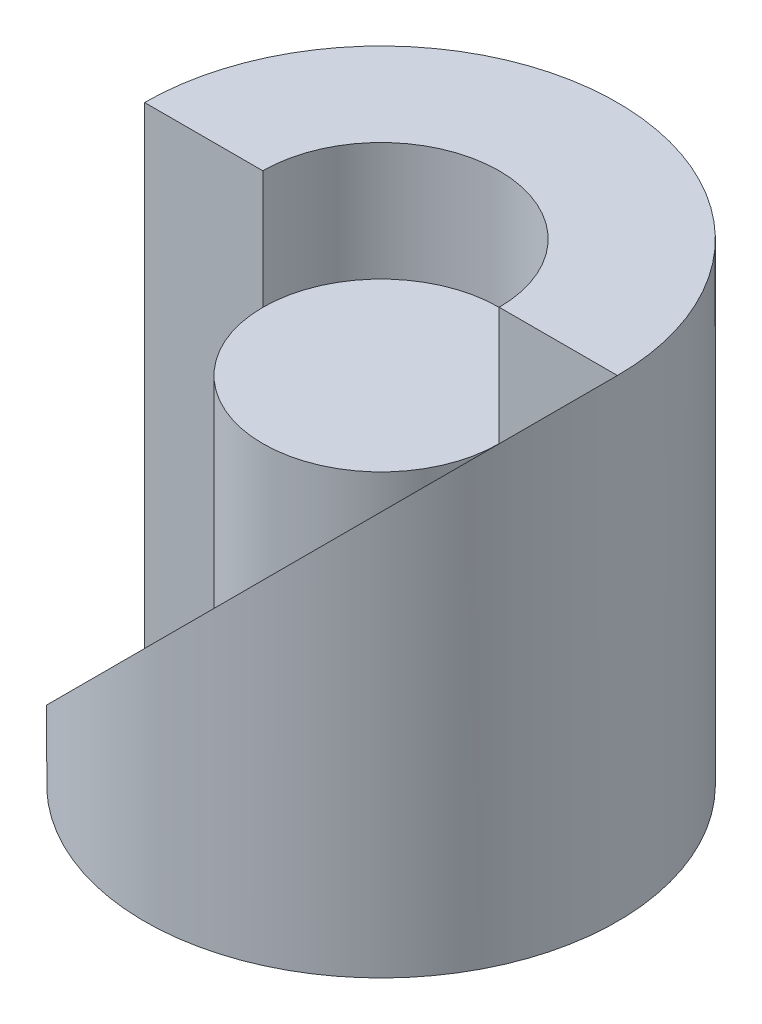
ISO-10303-21;
HEADER;
FILE_DESCRIPTION(('STEP AP214'),'2;1');
FILE_NAME('part.step','',(''),(''),'','','');
FILE_SCHEMA(('AUTOMOTIVE_DESIGN { 1 0 10303 214 1 1 1 1 }'));
ENDSEC;
DATA;
#1=APPLICATION_CONTEXT('core data for automotive mechanical design processes');
#2=APPLICATION_PROTOCOL_DEFINITION('international standard','automotive_design',2000,#1);
#3=PRODUCT_CONTEXT('',#1,'mechanical');
#4=PRODUCT('Part','Part','',(#3));
#5=PRODUCT_RELATED_PRODUCT_CATEGORY('part','',(#4));
#6=PRODUCT_DEFINITION_FORMATION('','',#4);
#7=PRODUCT_DEFINITION_CONTEXT('part definition',#1,'design');
#8=PRODUCT_DEFINITION('design','',#6,#7);
#9=PRODUCT_DEFINITION_SHAPE('','',#8);
#10=(LENGTH_UNIT() NAMED_UNIT(*) SI_UNIT(.MILLI.,.METRE.));
#11=(NAMED_UNIT(*) PLANE_ANGLE_UNIT() SI_UNIT($,.RADIAN.));
#12=(NAMED_UNIT(*) SI_UNIT($,.STERADIAN.) SOLID_ANGLE_UNIT());
#13=UNCERTAINTY_MEASURE_WITH_UNIT(LENGTH_MEASURE(1.E-05),#10,'distance_accuracy_value','');
#14=(GEOMETRIC_REPRESENTATION_CONTEXT(3) GLOBAL_UNCERTAINTY_ASSIGNED_CONTEXT((#13)) GLOBAL_UNIT_ASSIGNED_CONTEXT((#10,
#11,#12)) REPRESENTATION_CONTEXT('',''));
#15=CARTESIAN_POINT('',(0.,0.,0.));
#16=DIRECTION('',(0.,0.,1.));
#17=DIRECTION('',(1.,0.,0.));
#18=AXIS2_PLACEMENT_3D('',#15,#16,#17);
#19=CARTESIAN_POINT('',(0.,30.,0.));
#20=DIRECTION('',(0.,-1.,0.));
#21=DIRECTION('',(0.,0.,-1.));
#22=AXIS2_PLACEMENT_3D('',#19,#20,#21);
#23=CYLINDRICAL_SURFACE('',#22,9.99260939755064);
#24=CARTESIAN_POINT('',(0.,30.,0.));
#25=DIRECTION('',(0.,1.,0.));
#26=DIRECTION('',(0.,0.,1.));
#27=AXIS2_PLACEMENT_3D('',#24,#25,#26);
#28=CIRCLE('',#27,9.99260939755064);
#29=CARTESIAN_POINT('',(0.,30.,9.99260939755064));
#30=VERTEX_POINT('',#29);
#31=EDGE_CURVE('E11',#30,#30,#28,.T.);
#32=ORIENTED_EDGE('',*,*,#31,.F.);
#33=EDGE_LOOP('',(#32));
#34=FACE_BOUND('',#33,.T.);
#35=CARTESIAN_POINT('',(0.,0.,0.));
#36=DIRECTION('',(0.,1.,0.));
#37=DIRECTION('',(0.,0.,1.));
#38=AXIS2_PLACEMENT_3D('',#35,#36,#37);
#39=CIRCLE('',#38,9.99260939755064);
#40=CARTESIAN_POINT('',(0.,0.,9.99260939755064));
#41=VERTEX_POINT('',#40);
#42=EDGE_CURVE('E44',#41,#41,#39,.T.);
#43=ORIENTED_EDGE('',*,*,#42,.T.);
#44=EDGE_LOOP('',(#43));
#45=FACE_BOUND('',#44,.T.);
#46=ADVANCED_FACE('F41',(#34,#45),#23,.T.);
#47=CARTESIAN_POINT('',(0.,30.,0.));
#48=DIRECTION('',(0.,1.,0.));
#49=DIRECTION('',(0.,0.,1.));
#50=AXIS2_PLACEMENT_3D('',#47,#48,#49);
#51=PLANE('',#50);
#52=ORIENTED_EDGE('',*,*,#31,.T.);
#53=EDGE_LOOP('',(#52));
#54=FACE_BOUND('',#53,.T.);
#55=ADVANCED_FACE('F56',(#54),#51,.T.);
#56=CARTESIAN_POINT('',(0.,0.,0.));
#57=DIRECTION('',(0.,1.,0.));
#58=DIRECTION('',(0.,0.,1.));
#59=AXIS2_PLACEMENT_3D('',#56,#57,#58);
#60=PLANE('',#59);
#61=ORIENTED_EDGE('',*,*,#42,.F.);
#62=EDGE_LOOP('',(#61));
#63=FACE_BOUND('',#62,.T.);
#64=ADVANCED_FACE('F54',(#63),#60,.F.);
#65=CLOSED_SHELL('',(#46,#55,#64));
#66=MANIFOLD_SOLID_BREP('B2',#65);
#67=CARTESIAN_POINT('',(0.,40.,0.));
#68=DIRECTION('',(0.,-1.,0.));
#69=DIRECTION('',(0.,0.,-1.));
#70=AXIS2_PLACEMENT_3D('',#67,#68,#69);
#71=CYLINDRICAL_SURFACE('',#70,20.);
#72=CARTESIAN_POINT('',(0.,20.,0.));
#73=DIRECTION('',(-0.707106781186548,0.707106781186548,0.));
#74=DIRECTION('',(-0.707106781186548,-0.707106781186548,0.));
#75=AXIS2_PLACEMENT_3D('',#72,#73,#74);
#76=ELLIPSE('',#75,28.2842712474619,20.);
#77=CARTESIAN_POINT('',(-20.,0.,0.));
#78=VERTEX_POINT('',#77);
#79=CARTESIAN_POINT('',(20.,40.,0.));
#80=VERTEX_POINT('',#79);
#81=EDGE_CURVE('E118',#78,#80,#76,.T.);
#82=ORIENTED_EDGE('',*,*,#81,.F.);
#83=CARTESIAN_POINT('',(0.,0.,0.));
#84=DIRECTION('',(0.,1.,0.));
#85=DIRECTION('',(0.,0.,1.));
#86=AXIS2_PLACEMENT_3D('',#83,#84,#85);
#87=CIRCLE('',#86,20.);
#88=EDGE_CURVE('E134',#78,#78,#87,.T.);
#89=ORIENTED_EDGE('',*,*,#88,.T.);
#90=DIRECTION('',(0.,-1.,0.));
#91=VECTOR('',#90,1.);
#92=CARTESIAN_POINT('',(-20.,40.,0.));
#93=LINE('',#92,#91);
#94=CARTESIAN_POINT('',(-20.,40.,0.));
#95=VERTEX_POINT('',#94);
#96=EDGE_CURVE('E125',#95,#78,#93,.T.);
#97=ORIENTED_EDGE('',*,*,#96,.F.);
#98=CARTESIAN_POINT('',(0.,40.,0.));
#99=DIRECTION('',(0.,1.,0.));
#100=DIRECTION('',(0.,0.,1.));
#101=AXIS2_PLACEMENT_3D('',#98,#99,#100);
#102=CIRCLE('',#101,20.);
#103=EDGE_CURVE('E135',#80,#95,#102,.T.);
#104=ORIENTED_EDGE('',*,*,#103,.F.);
#105=EDGE_LOOP('',(#82,#89,#97,#104));
#106=FACE_BOUND('',#105,.T.);
#107=ADVANCED_FACE('F82',(#106),#71,.T.);
#108=CARTESIAN_POINT('',(0.,40.,0.));
#109=DIRECTION('',(0.,1.,0.));
#110=DIRECTION('',(0.,0.,1.));
#111=AXIS2_PLACEMENT_3D('',#108,#109,#110);
#112=PLANE('',#111);
#113=DIRECTION('',(-1.,0.,0.));
#114=VECTOR('',#113,1.);
#115=CARTESIAN_POINT('',(20.,40.,0.));
#116=LINE('',#115,#114);
#117=CARTESIAN_POINT('',(10.,40.,0.));
#118=VERTEX_POINT('',#117);
#119=EDGE_CURVE('E137',#80,#118,#116,.T.);
#120=ORIENTED_EDGE('',*,*,#119,.F.);
#121=ORIENTED_EDGE('',*,*,#103,.T.);
#122=CARTESIAN_POINT('',(-10.,40.,0.));
#123=VERTEX_POINT('',#122);
#124=EDGE_CURVE('E121',#123,#95,#116,.T.);
#125=ORIENTED_EDGE('',*,*,#124,.F.);
#126=CARTESIAN_POINT('',(0.,40.,0.));
#127=DIRECTION('',(0.,1.,0.));
#128=DIRECTION('',(0.,0.,1.));
#129=AXIS2_PLACEMENT_3D('',#126,#127,#128);
#130=CIRCLE('',#129,10.);
#131=EDGE_CURVE('E140',#118,#123,#130,.T.);
#132=ORIENTED_EDGE('',*,*,#131,.F.);
#133=EDGE_LOOP('',(#120,#121,#125,#132));
#134=FACE_BOUND('',#133,.T.);
#135=ADVANCED_FACE('F155',(#134),#112,.T.);
#136=CARTESIAN_POINT('',(0.,0.,0.));
#137=DIRECTION('',(0.,1.,0.));
#138=DIRECTION('',(0.,0.,1.));
#139=AXIS2_PLACEMENT_3D('',#136,#137,#138);
#140=PLANE('',#139);
#141=ORIENTED_EDGE('',*,*,#88,.F.);
#142=EDGE_LOOP('',(#141));
#143=FACE_BOUND('',#142,.T.);
#144=CARTESIAN_POINT('',(0.,0.,0.));
#145=DIRECTION('',(0.,1.,0.));
#146=DIRECTION('',(0.,0.,1.));
#147=AXIS2_PLACEMENT_3D('',#144,#145,#146);
#148=CIRCLE('',#147,10.);
#149=CARTESIAN_POINT('',(0.,0.,10.));
#150=VERTEX_POINT('',#149);
#151=EDGE_CURVE('E136',#150,#150,#148,.T.);
#152=ORIENTED_EDGE('',*,*,#151,.T.);
#153=EDGE_LOOP('',(#152));
#154=FACE_BOUND('',#153,.T.);
#155=ADVANCED_FACE('F168',(#143,#154),#140,.F.);
#156=CARTESIAN_POINT('',(0.,40.,0.));
#157=DIRECTION('',(0.,-1.,0.));
#158=DIRECTION('',(0.,0.,-1.));
#159=AXIS2_PLACEMENT_3D('',#156,#157,#158);
#160=CYLINDRICAL_SURFACE('',#159,10.);
#161=DIRECTION('',(0.,-1.,0.));
#162=VECTOR('',#161,1.);
#163=CARTESIAN_POINT('',(10.,40.,0.));
#164=LINE('',#163,#162);
#165=CARTESIAN_POINT('',(10.,30.,0.));
#166=VERTEX_POINT('',#165);
#167=EDGE_CURVE('E39',#118,#166,#164,.T.);
#168=ORIENTED_EDGE('',*,*,#167,.F.);
#169=ORIENTED_EDGE('',*,*,#131,.T.);
#170=DIRECTION('',(0.,-1.,0.));
#171=VECTOR('',#170,1.);
#172=CARTESIAN_POINT('',(-10.,40.,0.));
#173=LINE('',#172,#171);
#174=CARTESIAN_POINT('',(-10.,10.,0.));
#175=VERTEX_POINT('',#174);
#176=EDGE_CURVE('E147',#175,#123,#173,.F.);
#177=ORIENTED_EDGE('',*,*,#176,.F.);
#178=CARTESIAN_POINT('',(0.,20.,0.));
#179=DIRECTION('',(-0.707106781186548,0.707106781186548,0.));
#180=DIRECTION('',(-0.707106781186548,-0.707106781186548,0.));
#181=AXIS2_PLACEMENT_3D('',#178,#179,#180);
#182=ELLIPSE('',#181,14.1421356237309,10.);
#183=EDGE_CURVE('E89',#175,#166,#182,.T.);
#184=ORIENTED_EDGE('',*,*,#183,.T.);
#185=EDGE_LOOP('',(#168,#169,#177,#184));
#186=FACE_BOUND('',#185,.T.);
#187=ORIENTED_EDGE('',*,*,#151,.F.);
#188=EDGE_LOOP('',(#187));
#189=FACE_BOUND('',#188,.T.);
#190=ADVANCED_FACE('F150',(#186,#189),#160,.F.);
#191=CARTESIAN_POINT('',(-20.,0.,40.));
#192=DIRECTION('',(-0.707106781186548,0.707106781186548,0.));
#193=DIRECTION('',(-0.707106781186548,-0.707106781186548,0.));
#194=AXIS2_PLACEMENT_3D('',#191,#192,#193);
#195=PLANE('',#194);
#196=ORIENTED_EDGE('',*,*,#81,.T.);
#197=DIRECTION('',(0.707106781186548,0.707106781186548,0.));
#198=VECTOR('',#197,1.);
#199=CARTESIAN_POINT('',(-20.,0.,0.));
#200=LINE('',#199,#198);
#201=EDGE_CURVE('E122',#166,#80,#200,.T.);
#202=ORIENTED_EDGE('',*,*,#201,.F.);
#203=ORIENTED_EDGE('',*,*,#183,.F.);
#204=EDGE_CURVE('E96',#78,#175,#200,.T.);
#205=ORIENTED_EDGE('',*,*,#204,.F.);
#206=EDGE_LOOP('',(#196,#202,#203,#205));
#207=FACE_BOUND('',#206,.T.);
#208=ADVANCED_FACE('F116',(#207),#195,.T.);
#209=CARTESIAN_POINT('',(0.,0.,0.));
#210=DIRECTION('',(0.,0.,-1.));
#211=DIRECTION('',(-1.,0.,0.));
#212=AXIS2_PLACEMENT_3D('',#209,#210,#211);
#213=PLANE('',#212);
#214=ORIENTED_EDGE('',*,*,#167,.T.);
#215=ORIENTED_EDGE('',*,*,#201,.T.);
#216=ORIENTED_EDGE('',*,*,#119,.T.);
#217=EDGE_LOOP('',(#214,#215,#216));
#218=FACE_BOUND('',#217,.T.);
#219=ADVANCED_FACE('F156',(#218),#213,.F.);
#220=ORIENTED_EDGE('',*,*,#176,.T.);
#221=ORIENTED_EDGE('',*,*,#124,.T.);
#222=ORIENTED_EDGE('',*,*,#96,.T.);
#223=ORIENTED_EDGE('',*,*,#204,.T.);
#224=EDGE_LOOP('',(#220,#221,#222,#223));
#225=FACE_BOUND('',#224,.T.);
#226=ADVANCED_FACE('F126',(#225),#213,.F.);
#227=CLOSED_SHELL('',(#107,#135,#155,#190,#208,#219,#226));
#228=MANIFOLD_SOLID_BREP('B6',#227);
#229=ADVANCED_BREP_SHAPE_REPRESENTATION('',(#18,#66,#228),#14);
#230=SHAPE_DEFINITION_REPRESENTATION(#9,#229);
ENDSEC;
END-ISO-10303-21;
